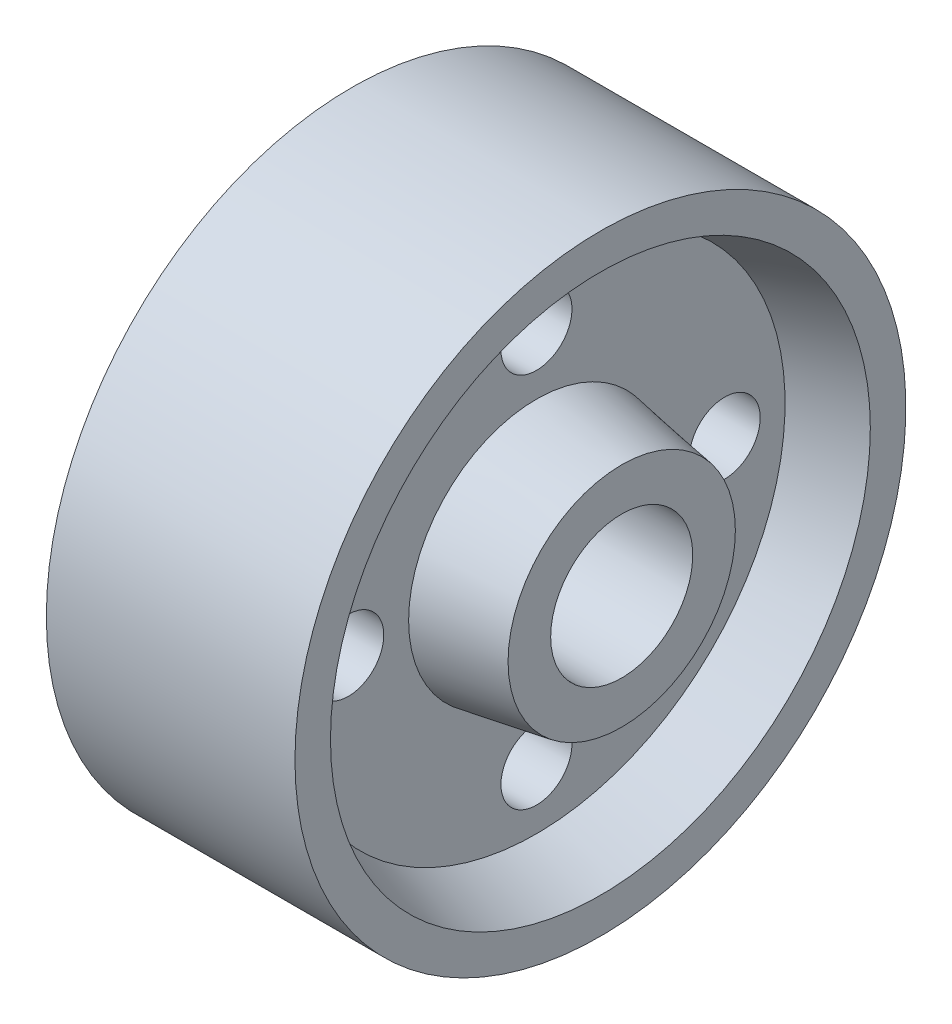
ISO-10303-21;
HEADER;
FILE_DESCRIPTION(('STEP AP214'),'2;1');
FILE_NAME('part.step','',(''),(''),'','','');
FILE_SCHEMA(('AUTOMOTIVE_DESIGN { 1 0 10303 214 1 1 1 1 }'));
ENDSEC;
DATA;
#1=APPLICATION_CONTEXT('core data for automotive mechanical design processes');
#2=APPLICATION_PROTOCOL_DEFINITION('international standard','automotive_design',2000,#1);
#3=PRODUCT_CONTEXT('',#1,'mechanical');
#4=PRODUCT('Part','Part','',(#3));
#5=PRODUCT_RELATED_PRODUCT_CATEGORY('part','',(#4));
#6=PRODUCT_DEFINITION_FORMATION('','',#4);
#7=PRODUCT_DEFINITION_CONTEXT('part definition',#1,'design');
#8=PRODUCT_DEFINITION('design','',#6,#7);
#9=PRODUCT_DEFINITION_SHAPE('','',#8);
#10=(LENGTH_UNIT() NAMED_UNIT(*) SI_UNIT(.MILLI.,.METRE.));
#11=(NAMED_UNIT(*) PLANE_ANGLE_UNIT() SI_UNIT($,.RADIAN.));
#12=(NAMED_UNIT(*) SI_UNIT($,.STERADIAN.) SOLID_ANGLE_UNIT());
#13=UNCERTAINTY_MEASURE_WITH_UNIT(LENGTH_MEASURE(1.E-05),#10,'distance_accuracy_value','');
#14=(GEOMETRIC_REPRESENTATION_CONTEXT(3) GLOBAL_UNCERTAINTY_ASSIGNED_CONTEXT((#13)) GLOBAL_UNIT_ASSIGNED_CONTEXT((#10,
#11,#12)) REPRESENTATION_CONTEXT('',''));
#15=CARTESIAN_POINT('',(0.,0.,0.));
#16=DIRECTION('',(0.,0.,1.));
#17=DIRECTION('',(1.,0.,0.));
#18=AXIS2_PLACEMENT_3D('',#15,#16,#17);
#19=CARTESIAN_POINT('',(41.,0.,0.));
#20=DIRECTION('',(-1.,0.,0.));
#21=DIRECTION('',(0.,0.,1.));
#22=AXIS2_PLACEMENT_3D('',#19,#20,#21);
#23=PLANE('',#22);
#24=CARTESIAN_POINT('',(41.,0.,0.));
#25=DIRECTION('',(-1.,0.,0.));
#26=DIRECTION('',(0.,0.,1.));
#27=AXIS2_PLACEMENT_3D('',#24,#25,#26);
#28=CIRCLE('',#27,10.);
#29=CARTESIAN_POINT('',(41.,0.,10.));
#30=VERTEX_POINT('',#29);
#31=EDGE_CURVE('E57',#30,#30,#28,.T.);
#32=ORIENTED_EDGE('',*,*,#31,.T.);
#33=EDGE_LOOP('',(#32));
#34=FACE_BOUND('',#33,.T.);
#35=CARTESIAN_POINT('',(41.,0.,0.));
#36=DIRECTION('',(-1.,0.,0.));
#37=DIRECTION('',(0.,0.,1.));
#38=AXIS2_PLACEMENT_3D('',#35,#36,#37);
#39=CIRCLE('',#38,16.);
#40=CARTESIAN_POINT('',(41.,0.,16.));
#41=VERTEX_POINT('',#40);
#42=EDGE_CURVE('E10',#41,#41,#39,.T.);
#43=ORIENTED_EDGE('',*,*,#42,.F.);
#44=EDGE_LOOP('',(#43));
#45=FACE_BOUND('',#44,.T.);
#46=ADVANCED_FACE('F37',(#34,#45),#23,.F.);
#47=CARTESIAN_POINT('',(41.,0.,0.));
#48=DIRECTION('',(-1.,0.,0.));
#49=DIRECTION('',(0.,0.,1.));
#50=AXIS2_PLACEMENT_3D('',#47,#48,#49);
#51=CONICAL_SURFACE('',#50,16.,0.165148677414627);
#52=CARTESIAN_POINT('',(29.,0.,0.));
#53=DIRECTION('',(-1.,0.,0.));
#54=DIRECTION('',(0.,0.,1.));
#55=AXIS2_PLACEMENT_3D('',#52,#53,#54);
#56=CIRCLE('',#55,18.);
#57=CARTESIAN_POINT('',(29.,0.,18.));
#58=VERTEX_POINT('',#57);
#59=EDGE_CURVE('E44',#58,#58,#56,.T.);
#60=ORIENTED_EDGE('',*,*,#59,.F.);
#61=EDGE_LOOP('',(#60));
#62=FACE_BOUND('',#61,.T.);
#63=ORIENTED_EDGE('',*,*,#42,.T.);
#64=EDGE_LOOP('',(#63));
#65=FACE_BOUND('',#64,.T.);
#66=ADVANCED_FACE('F106',(#62,#65),#51,.T.);
#67=CARTESIAN_POINT('',(29.,0.,-18.));
#68=DIRECTION('',(-1.,0.,0.));
#69=DIRECTION('',(0.,0.,1.));
#70=AXIS2_PLACEMENT_3D('',#67,#68,#69);
#71=PLANE('',#70);
#72=CARTESIAN_POINT('',(29.,26.4990977239819,0.));
#73=DIRECTION('',(-1.,0.,0.));
#74=DIRECTION('',(0.,0.,1.));
#75=AXIS2_PLACEMENT_3D('',#72,#73,#74);
#76=CIRCLE('',#75,5.);
#77=CARTESIAN_POINT('',(29.,26.4990977239819,5.));
#78=VERTEX_POINT('',#77);
#79=EDGE_CURVE('E75',#78,#78,#76,.T.);
#80=ORIENTED_EDGE('',*,*,#79,.T.);
#81=EDGE_LOOP('',(#80));
#82=FACE_BOUND('',#81,.T.);
#83=CARTESIAN_POINT('',(29.,0.,26.4990977239819));
#84=DIRECTION('',(-1.,0.,0.));
#85=DIRECTION('',(0.,0.,1.));
#86=AXIS2_PLACEMENT_3D('',#83,#84,#85);
#87=CIRCLE('',#86,5.);
#88=CARTESIAN_POINT('',(29.,0.,31.4990977239819));
#89=VERTEX_POINT('',#88);
#90=EDGE_CURVE('E63',#89,#89,#87,.T.);
#91=ORIENTED_EDGE('',*,*,#90,.T.);
#92=EDGE_LOOP('',(#91));
#93=FACE_BOUND('',#92,.T.);
#94=CARTESIAN_POINT('',(29.,-26.4990977239819,-1.8474805019153E-13));
#95=DIRECTION('',(-1.,0.,0.));
#96=DIRECTION('',(0.,0.,1.));
#97=AXIS2_PLACEMENT_3D('',#94,#95,#96);
#98=CIRCLE('',#97,5.);
#99=CARTESIAN_POINT('',(29.,-26.4990977239819,4.99999999999982));
#100=VERTEX_POINT('',#99);
#101=EDGE_CURVE('E60',#100,#100,#98,.T.);
#102=ORIENTED_EDGE('',*,*,#101,.T.);
#103=EDGE_LOOP('',(#102));
#104=FACE_BOUND('',#103,.T.);
#105=CARTESIAN_POINT('',(29.,2.77555756156289E-13,-26.4990977239819));
#106=DIRECTION('',(-1.,0.,0.));
#107=DIRECTION('',(0.,0.,1.));
#108=AXIS2_PLACEMENT_3D('',#105,#106,#107);
#109=CIRCLE('',#108,5.);
#110=CARTESIAN_POINT('',(29.,2.77555756156289E-13,-21.4990977239819));
#111=VERTEX_POINT('',#110);
#112=EDGE_CURVE('E56',#111,#111,#109,.T.);
#113=ORIENTED_EDGE('',*,*,#112,.T.);
#114=EDGE_LOOP('',(#113));
#115=FACE_BOUND('',#114,.T.);
#116=CARTESIAN_POINT('',(29.,0.,0.));
#117=DIRECTION('',(-1.,0.,0.));
#118=DIRECTION('',(0.,0.,1.));
#119=AXIS2_PLACEMENT_3D('',#116,#117,#118);
#120=CIRCLE('',#119,35.);
#121=CARTESIAN_POINT('',(29.,0.,35.));
#122=VERTEX_POINT('',#121);
#123=EDGE_CURVE('E49',#122,#122,#120,.T.);
#124=ORIENTED_EDGE('',*,*,#123,.F.);
#125=EDGE_LOOP('',(#124));
#126=FACE_BOUND('',#125,.T.);
#127=ORIENTED_EDGE('',*,*,#59,.T.);
#128=EDGE_LOOP('',(#127));
#129=FACE_BOUND('',#128,.T.);
#130=ADVANCED_FACE('F103',(#82,#93,#104,#115,#126,#129),#71,.F.);
#131=CARTESIAN_POINT('',(29.,0.,0.));
#132=DIRECTION('',(1.,0.,0.));
#133=DIRECTION('',(0.,0.,-1.));
#134=AXIS2_PLACEMENT_3D('',#131,#132,#133);
#135=CONICAL_SURFACE('',#134,35.,0.321750554396642);
#136=CARTESIAN_POINT('',(38.,0.,0.));
#137=DIRECTION('',(-1.,0.,0.));
#138=DIRECTION('',(0.,0.,1.));
#139=AXIS2_PLACEMENT_3D('',#136,#137,#138);
#140=CIRCLE('',#139,38.);
#141=CARTESIAN_POINT('',(38.,0.,38.));
#142=VERTEX_POINT('',#141);
#143=EDGE_CURVE('E96',#142,#142,#140,.T.);
#144=ORIENTED_EDGE('',*,*,#143,.F.);
#145=EDGE_LOOP('',(#144));
#146=FACE_BOUND('',#145,.T.);
#147=ORIENTED_EDGE('',*,*,#123,.T.);
#148=EDGE_LOOP('',(#147));
#149=FACE_BOUND('',#148,.T.);
#150=ADVANCED_FACE('F101',(#146,#149),#135,.F.);
#151=CARTESIAN_POINT('',(38.,0.,-38.));
#152=DIRECTION('',(-1.,0.,0.));
#153=DIRECTION('',(0.,0.,1.));
#154=AXIS2_PLACEMENT_3D('',#151,#152,#153);
#155=PLANE('',#154);
#156=CARTESIAN_POINT('',(38.,0.,0.));
#157=DIRECTION('',(-1.,0.,0.));
#158=DIRECTION('',(0.,0.,1.));
#159=AXIS2_PLACEMENT_3D('',#156,#157,#158);
#160=CIRCLE('',#159,43.);
#161=CARTESIAN_POINT('',(38.,0.,43.));
#162=VERTEX_POINT('',#161);
#163=EDGE_CURVE('E93',#162,#162,#160,.T.);
#164=ORIENTED_EDGE('',*,*,#163,.F.);
#165=EDGE_LOOP('',(#164));
#166=FACE_BOUND('',#165,.T.);
#167=ORIENTED_EDGE('',*,*,#143,.T.);
#168=EDGE_LOOP('',(#167));
#169=FACE_BOUND('',#168,.T.);
#170=ADVANCED_FACE('F119',(#166,#169),#155,.F.);
#171=CARTESIAN_POINT('',(0.,0.,0.));
#172=DIRECTION('',(-1.,0.,0.));
#173=DIRECTION('',(0.,0.,1.));
#174=AXIS2_PLACEMENT_3D('',#171,#172,#173);
#175=CYLINDRICAL_SURFACE('',#174,43.);
#176=CARTESIAN_POINT('',(2.99999999999999,0.,0.));
#177=DIRECTION('',(-1.,0.,0.));
#178=DIRECTION('',(0.,0.,1.));
#179=AXIS2_PLACEMENT_3D('',#176,#177,#178);
#180=CIRCLE('',#179,43.);
#181=CARTESIAN_POINT('',(2.99999999999999,0.,43.));
#182=VERTEX_POINT('',#181);
#183=EDGE_CURVE('E90',#182,#182,#180,.T.);
#184=ORIENTED_EDGE('',*,*,#183,.F.);
#185=EDGE_LOOP('',(#184));
#186=FACE_BOUND('',#185,.T.);
#187=ORIENTED_EDGE('',*,*,#163,.T.);
#188=EDGE_LOOP('',(#187));
#189=FACE_BOUND('',#188,.T.);
#190=ADVANCED_FACE('F123',(#186,#189),#175,.T.);
#191=CARTESIAN_POINT('',(2.99999999999999,0.,-38.));
#192=DIRECTION('',(1.,0.,0.));
#193=DIRECTION('',(0.,0.,-1.));
#194=AXIS2_PLACEMENT_3D('',#191,#192,#193);
#195=PLANE('',#194);
#196=CARTESIAN_POINT('',(2.99999999999999,0.,0.));
#197=DIRECTION('',(-1.,0.,0.));
#198=DIRECTION('',(0.,0.,1.));
#199=AXIS2_PLACEMENT_3D('',#196,#197,#198);
#200=CIRCLE('',#199,38.);
#201=CARTESIAN_POINT('',(2.99999999999999,0.,38.));
#202=VERTEX_POINT('',#201);
#203=EDGE_CURVE('E87',#202,#202,#200,.T.);
#204=ORIENTED_EDGE('',*,*,#203,.F.);
#205=EDGE_LOOP('',(#204));
#206=FACE_BOUND('',#205,.T.);
#207=ORIENTED_EDGE('',*,*,#183,.T.);
#208=EDGE_LOOP('',(#207));
#209=FACE_BOUND('',#208,.T.);
#210=ADVANCED_FACE('F127',(#206,#209),#195,.F.);
#211=CARTESIAN_POINT('',(2.99999999999999,0.,0.));
#212=DIRECTION('',(-1.,0.,0.));
#213=DIRECTION('',(0.,0.,1.));
#214=AXIS2_PLACEMENT_3D('',#211,#212,#213);
#215=CONICAL_SURFACE('',#214,38.,0.321750554396642);
#216=CARTESIAN_POINT('',(12.,0.,0.));
#217=DIRECTION('',(-1.,0.,0.));
#218=DIRECTION('',(0.,0.,1.));
#219=AXIS2_PLACEMENT_3D('',#216,#217,#218);
#220=CIRCLE('',#219,35.);
#221=CARTESIAN_POINT('',(12.,0.,35.));
#222=VERTEX_POINT('',#221);
#223=EDGE_CURVE('E84',#222,#222,#220,.T.);
#224=ORIENTED_EDGE('',*,*,#223,.F.);
#225=EDGE_LOOP('',(#224));
#226=FACE_BOUND('',#225,.T.);
#227=ORIENTED_EDGE('',*,*,#203,.T.);
#228=EDGE_LOOP('',(#227));
#229=FACE_BOUND('',#228,.T.);
#230=ADVANCED_FACE('F131',(#226,#229),#215,.F.);
#231=CARTESIAN_POINT('',(12.,0.,-18.));
#232=DIRECTION('',(1.,0.,0.));
#233=DIRECTION('',(0.,0.,-1.));
#234=AXIS2_PLACEMENT_3D('',#231,#232,#233);
#235=PLANE('',#234);
#236=CARTESIAN_POINT('',(12.,26.4990977239819,0.));
#237=DIRECTION('',(1.,0.,0.));
#238=DIRECTION('',(0.,0.,-1.));
#239=AXIS2_PLACEMENT_3D('',#236,#237,#238);
#240=CIRCLE('',#239,5.);
#241=CARTESIAN_POINT('',(12.,26.4990977239819,-5.));
#242=VERTEX_POINT('',#241);
#243=EDGE_CURVE('E40',#242,#242,#240,.T.);
#244=ORIENTED_EDGE('',*,*,#243,.T.);
#245=EDGE_LOOP('',(#244));
#246=FACE_BOUND('',#245,.T.);
#247=CARTESIAN_POINT('',(12.,0.,26.4990977239819));
#248=DIRECTION('',(1.,0.,0.));
#249=DIRECTION('',(0.,0.,-1.));
#250=AXIS2_PLACEMENT_3D('',#247,#248,#249);
#251=CIRCLE('',#250,5.);
#252=CARTESIAN_POINT('',(12.,0.,21.4990977239819));
#253=VERTEX_POINT('',#252);
#254=EDGE_CURVE('E61',#253,#253,#251,.T.);
#255=ORIENTED_EDGE('',*,*,#254,.T.);
#256=EDGE_LOOP('',(#255));
#257=FACE_BOUND('',#256,.T.);
#258=CARTESIAN_POINT('',(12.,-26.4990977239819,-1.8474805019153E-13));
#259=DIRECTION('',(1.,0.,0.));
#260=DIRECTION('',(0.,0.,-1.));
#261=AXIS2_PLACEMENT_3D('',#258,#259,#260);
#262=CIRCLE('',#261,5.);
#263=CARTESIAN_POINT('',(12.,-26.4990977239819,-5.00000000000019));
#264=VERTEX_POINT('',#263);
#265=EDGE_CURVE('E58',#264,#264,#262,.T.);
#266=ORIENTED_EDGE('',*,*,#265,.T.);
#267=EDGE_LOOP('',(#266));
#268=FACE_BOUND('',#267,.T.);
#269=CARTESIAN_POINT('',(12.,2.77555756156289E-13,-26.4990977239819));
#270=DIRECTION('',(1.,0.,0.));
#271=DIRECTION('',(0.,0.,-1.));
#272=AXIS2_PLACEMENT_3D('',#269,#270,#271);
#273=CIRCLE('',#272,5.);
#274=CARTESIAN_POINT('',(12.,2.77555756156289E-13,-31.4990977239819));
#275=VERTEX_POINT('',#274);
#276=EDGE_CURVE('E53',#275,#275,#273,.T.);
#277=ORIENTED_EDGE('',*,*,#276,.T.);
#278=EDGE_LOOP('',(#277));
#279=FACE_BOUND('',#278,.T.);
#280=CARTESIAN_POINT('',(12.,0.,0.));
#281=DIRECTION('',(-1.,0.,0.));
#282=DIRECTION('',(0.,0.,1.));
#283=AXIS2_PLACEMENT_3D('',#280,#281,#282);
#284=CIRCLE('',#283,18.);
#285=CARTESIAN_POINT('',(12.,0.,18.));
#286=VERTEX_POINT('',#285);
#287=EDGE_CURVE('E81',#286,#286,#284,.T.);
#288=ORIENTED_EDGE('',*,*,#287,.F.);
#289=EDGE_LOOP('',(#288));
#290=FACE_BOUND('',#289,.T.);
#291=ORIENTED_EDGE('',*,*,#223,.T.);
#292=EDGE_LOOP('',(#291));
#293=FACE_BOUND('',#292,.T.);
#294=ADVANCED_FACE('F135',(#246,#257,#268,#279,#290,#293),#235,.F.);
#295=CARTESIAN_POINT('',(12.,0.,0.));
#296=DIRECTION('',(1.,0.,0.));
#297=DIRECTION('',(0.,0.,-1.));
#298=AXIS2_PLACEMENT_3D('',#295,#296,#297);
#299=CONICAL_SURFACE('',#298,18.,0.165148677414627);
#300=CARTESIAN_POINT('',(0.,0.,0.));
#301=DIRECTION('',(-1.,0.,0.));
#302=DIRECTION('',(0.,0.,1.));
#303=AXIS2_PLACEMENT_3D('',#300,#301,#302);
#304=CIRCLE('',#303,16.);
#305=CARTESIAN_POINT('',(0.,0.,16.));
#306=VERTEX_POINT('',#305);
#307=EDGE_CURVE('E78',#306,#306,#304,.T.);
#308=ORIENTED_EDGE('',*,*,#307,.F.);
#309=EDGE_LOOP('',(#308));
#310=FACE_BOUND('',#309,.T.);
#311=ORIENTED_EDGE('',*,*,#287,.T.);
#312=EDGE_LOOP('',(#311));
#313=FACE_BOUND('',#312,.T.);
#314=ADVANCED_FACE('F139',(#310,#313),#299,.T.);
#315=CARTESIAN_POINT('',(0.,0.,0.));
#316=DIRECTION('',(1.,0.,0.));
#317=DIRECTION('',(0.,0.,-1.));
#318=AXIS2_PLACEMENT_3D('',#315,#316,#317);
#319=PLANE('',#318);
#320=CARTESIAN_POINT('',(0.,0.,0.));
#321=DIRECTION('',(-1.,0.,0.));
#322=DIRECTION('',(0.,0.,1.));
#323=AXIS2_PLACEMENT_3D('',#320,#321,#322);
#324=CIRCLE('',#323,10.);
#325=CARTESIAN_POINT('',(0.,0.,10.));
#326=VERTEX_POINT('',#325);
#327=EDGE_CURVE('E174',#326,#326,#324,.T.);
#328=ORIENTED_EDGE('',*,*,#327,.F.);
#329=EDGE_LOOP('',(#328));
#330=FACE_BOUND('',#329,.T.);
#331=ORIENTED_EDGE('',*,*,#307,.T.);
#332=EDGE_LOOP('',(#331));
#333=FACE_BOUND('',#332,.T.);
#334=ADVANCED_FACE('F143',(#330,#333),#319,.F.);
#335=CARTESIAN_POINT('',(41.,2.77555756156289E-13,-26.4990977239819));
#336=DIRECTION('',(-1.,0.,0.));
#337=DIRECTION('',(0.,0.,1.));
#338=AXIS2_PLACEMENT_3D('',#335,#336,#337);
#339=CYLINDRICAL_SURFACE('',#338,5.);
#340=ORIENTED_EDGE('',*,*,#276,.F.);
#341=EDGE_LOOP('',(#340));
#342=FACE_BOUND('',#341,.T.);
#343=ORIENTED_EDGE('',*,*,#112,.F.);
#344=EDGE_LOOP('',(#343));
#345=FACE_BOUND('',#344,.T.);
#346=ADVANCED_FACE('F147',(#342,#345),#339,.F.);
#347=CARTESIAN_POINT('',(41.,-26.4990977239819,-1.8474805019153E-13));
#348=DIRECTION('',(-1.,0.,0.));
#349=DIRECTION('',(0.,0.,1.));
#350=AXIS2_PLACEMENT_3D('',#347,#348,#349);
#351=CYLINDRICAL_SURFACE('',#350,5.);
#352=ORIENTED_EDGE('',*,*,#265,.F.);
#353=EDGE_LOOP('',(#352));
#354=FACE_BOUND('',#353,.T.);
#355=ORIENTED_EDGE('',*,*,#101,.F.);
#356=EDGE_LOOP('',(#355));
#357=FACE_BOUND('',#356,.T.);
#358=ADVANCED_FACE('F151',(#354,#357),#351,.F.);
#359=CARTESIAN_POINT('',(41.,0.,26.4990977239819));
#360=DIRECTION('',(-1.,0.,0.));
#361=DIRECTION('',(0.,0.,1.));
#362=AXIS2_PLACEMENT_3D('',#359,#360,#361);
#363=CYLINDRICAL_SURFACE('',#362,5.);
#364=ORIENTED_EDGE('',*,*,#254,.F.);
#365=EDGE_LOOP('',(#364));
#366=FACE_BOUND('',#365,.T.);
#367=ORIENTED_EDGE('',*,*,#90,.F.);
#368=EDGE_LOOP('',(#367));
#369=FACE_BOUND('',#368,.T.);
#370=ADVANCED_FACE('F155',(#366,#369),#363,.F.);
#371=CARTESIAN_POINT('',(41.,26.4990977239819,0.));
#372=DIRECTION('',(-1.,0.,0.));
#373=DIRECTION('',(0.,0.,1.));
#374=AXIS2_PLACEMENT_3D('',#371,#372,#373);
#375=CYLINDRICAL_SURFACE('',#374,5.);
#376=ORIENTED_EDGE('',*,*,#243,.F.);
#377=EDGE_LOOP('',(#376));
#378=FACE_BOUND('',#377,.T.);
#379=ORIENTED_EDGE('',*,*,#79,.F.);
#380=EDGE_LOOP('',(#379));
#381=FACE_BOUND('',#380,.T.);
#382=ADVANCED_FACE('F159',(#378,#381),#375,.F.);
#383=CARTESIAN_POINT('',(41.,0.,0.));
#384=DIRECTION('',(-1.,0.,0.));
#385=DIRECTION('',(0.,0.,1.));
#386=AXIS2_PLACEMENT_3D('',#383,#384,#385);
#387=CYLINDRICAL_SURFACE('',#386,10.);
#388=ORIENTED_EDGE('',*,*,#31,.F.);
#389=EDGE_LOOP('',(#388));
#390=FACE_BOUND('',#389,.T.);
#391=ORIENTED_EDGE('',*,*,#327,.T.);
#392=EDGE_LOOP('',(#391));
#393=FACE_BOUND('',#392,.T.);
#394=ADVANCED_FACE('F163',(#390,#393),#387,.F.);
#395=CLOSED_SHELL('',(#46,#66,#130,#150,#170,#190,#210,#230,#294,#314,#334,#346,#358,#370,#382,#394));
#396=MANIFOLD_SOLID_BREP('B2',#395);
#397=ADVANCED_BREP_SHAPE_REPRESENTATION('',(#18,#396),#14);
#398=SHAPE_DEFINITION_REPRESENTATION(#9,#397);
ENDSEC;
END-ISO-10303-21;
